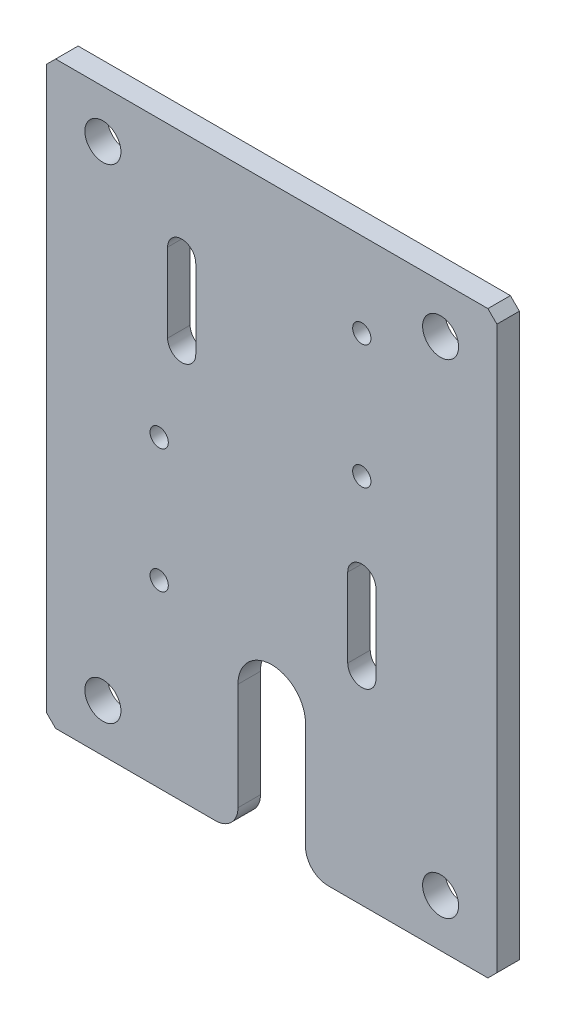
ISO-10303-21;
HEADER;
FILE_DESCRIPTION(('STEP AP214'),'2;1');
FILE_NAME('part.step','',(''),(''),'','','');
FILE_SCHEMA(('AUTOMOTIVE_DESIGN { 1 0 10303 214 1 1 1 1 }'));
ENDSEC;
DATA;
#1=APPLICATION_CONTEXT('core data for automotive mechanical design processes');
#2=APPLICATION_PROTOCOL_DEFINITION('international standard','automotive_design',2000,#1);
#3=PRODUCT_CONTEXT('',#1,'mechanical');
#4=PRODUCT('Part','Part','',(#3));
#5=PRODUCT_RELATED_PRODUCT_CATEGORY('part','',(#4));
#6=PRODUCT_DEFINITION_FORMATION('','',#4);
#7=PRODUCT_DEFINITION_CONTEXT('part definition',#1,'design');
#8=PRODUCT_DEFINITION('design','',#6,#7);
#9=PRODUCT_DEFINITION_SHAPE('','',#8);
#10=(LENGTH_UNIT() NAMED_UNIT(*) SI_UNIT(.MILLI.,.METRE.));
#11=(NAMED_UNIT(*) PLANE_ANGLE_UNIT() SI_UNIT($,.RADIAN.));
#12=(NAMED_UNIT(*) SI_UNIT($,.STERADIAN.) SOLID_ANGLE_UNIT());
#13=UNCERTAINTY_MEASURE_WITH_UNIT(LENGTH_MEASURE(1.E-05),#10,'distance_accuracy_value','');
#14=(GEOMETRIC_REPRESENTATION_CONTEXT(3) GLOBAL_UNCERTAINTY_ASSIGNED_CONTEXT((#13)) GLOBAL_UNIT_ASSIGNED_CONTEXT((#10,
#11,#12)) REPRESENTATION_CONTEXT('',''));
#15=CARTESIAN_POINT('',(0.,0.,0.));
#16=DIRECTION('',(0.,0.,1.));
#17=DIRECTION('',(1.,0.,0.));
#18=AXIS2_PLACEMENT_3D('',#15,#16,#17);
#19=CARTESIAN_POINT('',(20.,20.7000000430332,0.));
#20=DIRECTION('',(0.707106781186603,0.707106781186493,0.));
#21=DIRECTION('',(-0.707106781186493,0.707106781186603,0.));
#22=AXIS2_PLACEMENT_3D('',#19,#20,#21);
#23=PLANE('',#22);
#24=DIRECTION('',(-0.707106781186493,0.707106781186603,0.));
#25=VECTOR('',#24,1.);
#26=CARTESIAN_POINT('',(20.,20.7000000430332,2.));
#27=LINE('',#26,#25);
#28=CARTESIAN_POINT('',(19.2000000430334,21.5,2.));
#29=VERTEX_POINT('',#28);
#30=CARTESIAN_POINT('',(20.,20.7000000430332,2.));
#31=VERTEX_POINT('',#30);
#32=EDGE_CURVE('E306',#29,#31,#27,.F.);
#33=ORIENTED_EDGE('',*,*,#32,.T.);
#34=DIRECTION('',(0.,0.,-1.));
#35=VECTOR('',#34,1.);
#36=CARTESIAN_POINT('',(20.,20.7000000430332,0.));
#37=LINE('',#36,#35);
#38=CARTESIAN_POINT('',(20.,20.7000000430332,0.));
#39=VERTEX_POINT('',#38);
#40=EDGE_CURVE('E263',#39,#31,#37,.F.);
#41=ORIENTED_EDGE('',*,*,#40,.F.);
#42=DIRECTION('',(-0.707106781186457,0.707106781186638,0.));
#43=VECTOR('',#42,1.);
#44=CARTESIAN_POINT('',(20.,20.7000000430332,0.));
#45=LINE('',#44,#43);
#46=CARTESIAN_POINT('',(19.2000000430334,21.5,0.));
#47=VERTEX_POINT('',#46);
#48=EDGE_CURVE('E269',#39,#47,#45,.T.);
#49=ORIENTED_EDGE('',*,*,#48,.T.);
#50=DIRECTION('',(0.,0.,1.));
#51=VECTOR('',#50,1.);
#52=CARTESIAN_POINT('',(19.2000000430334,21.5,0.));
#53=LINE('',#52,#51);
#54=EDGE_CURVE('E254',#29,#47,#53,.F.);
#55=ORIENTED_EDGE('',*,*,#54,.F.);
#56=EDGE_LOOP('',(#33,#41,#49,#55));
#57=FACE_BOUND('',#56,.T.);
#58=ADVANCED_FACE('F16',(#57),#23,.T.);
#59=CARTESIAN_POINT('',(-19.2000000430334,21.5,0.));
#60=DIRECTION('',(-0.707106781186605,0.707106781186491,0.));
#61=DIRECTION('',(-0.707106781186491,-0.707106781186605,0.));
#62=AXIS2_PLACEMENT_3D('',#59,#60,#61);
#63=PLANE('',#62);
#64=DIRECTION('',(-0.707106781186491,-0.707106781186605,0.));
#65=VECTOR('',#64,1.);
#66=CARTESIAN_POINT('',(-19.2000000430334,21.5,2.));
#67=LINE('',#66,#65);
#68=CARTESIAN_POINT('',(-20.0000000430334,20.6999999999999,2.));
#69=VERTEX_POINT('',#68);
#70=CARTESIAN_POINT('',(-19.2000000430334,21.5,2.));
#71=VERTEX_POINT('',#70);
#72=EDGE_CURVE('E165',#69,#71,#67,.F.);
#73=ORIENTED_EDGE('',*,*,#72,.T.);
#74=DIRECTION('',(0.,0.,1.));
#75=VECTOR('',#74,1.);
#76=CARTESIAN_POINT('',(-19.2000000430334,21.5,0.));
#77=LINE('',#76,#75);
#78=CARTESIAN_POINT('',(-19.2000000430334,21.5,0.));
#79=VERTEX_POINT('',#78);
#80=EDGE_CURVE('E257',#79,#71,#77,.T.);
#81=ORIENTED_EDGE('',*,*,#80,.F.);
#82=DIRECTION('',(-0.707106781186501,-0.707106781186594,0.));
#83=VECTOR('',#82,1.);
#84=CARTESIAN_POINT('',(-19.2000000430334,21.5,0.));
#85=LINE('',#84,#83);
#86=CARTESIAN_POINT('',(-20.0000000430334,20.6999999999999,0.));
#87=VERTEX_POINT('',#86);
#88=EDGE_CURVE('E267',#79,#87,#85,.T.);
#89=ORIENTED_EDGE('',*,*,#88,.T.);
#90=DIRECTION('',(0.,0.,1.));
#91=VECTOR('',#90,1.);
#92=CARTESIAN_POINT('',(-20.0000000430334,20.6999999999999,0.));
#93=LINE('',#92,#91);
#94=EDGE_CURVE('E250',#69,#87,#93,.F.);
#95=ORIENTED_EDGE('',*,*,#94,.F.);
#96=EDGE_LOOP('',(#73,#81,#89,#95));
#97=FACE_BOUND('',#96,.T.);
#98=ADVANCED_FACE('F569',(#97),#63,.T.);
#99=CARTESIAN_POINT('',(-19.6000000430334,-29.6000000460307,0.));
#100=DIRECTION('',(-0.707106780524991,-0.707106781848104,0.));
#101=DIRECTION('',(0.707106781848104,-0.707106780524991,0.));
#102=AXIS2_PLACEMENT_3D('',#99,#100,#101);
#103=PLANE('',#102);
#104=DIRECTION('',(0.70710678184809,-0.707106780525005,0.));
#105=VECTOR('',#104,1.);
#106=CARTESIAN_POINT('',(-20.0000000430334,-29.2000000467791,0.));
#107=LINE('',#106,#105);
#108=CARTESIAN_POINT('',(-20.0000000430334,-29.2000000467791,0.));
#109=VERTEX_POINT('',#108);
#110=CARTESIAN_POINT('',(-19.2000000430334,-30.0000000452822,0.));
#111=VERTEX_POINT('',#110);
#112=EDGE_CURVE('E132',#109,#111,#107,.T.);
#113=ORIENTED_EDGE('',*,*,#112,.T.);
#114=DIRECTION('',(0.,0.,1.));
#115=VECTOR('',#114,1.);
#116=CARTESIAN_POINT('',(-19.2000000430334,-30.0000000452822,0.));
#117=LINE('',#116,#115);
#118=CARTESIAN_POINT('',(-19.2000000430334,-30.0000000452822,2.));
#119=VERTEX_POINT('',#118);
#120=EDGE_CURVE('E168',#119,#111,#117,.F.);
#121=ORIENTED_EDGE('',*,*,#120,.F.);
#122=DIRECTION('',(0.707106781848104,-0.707106780524991,0.));
#123=VECTOR('',#122,1.);
#124=CARTESIAN_POINT('',(-19.6000000430334,-29.6000000460307,2.));
#125=LINE('',#124,#123);
#126=CARTESIAN_POINT('',(-20.0000000430334,-29.2000000467791,2.));
#127=VERTEX_POINT('',#126);
#128=EDGE_CURVE('E154',#119,#127,#125,.F.);
#129=ORIENTED_EDGE('',*,*,#128,.T.);
#130=DIRECTION('',(0.,0.,1.));
#131=VECTOR('',#130,1.);
#132=CARTESIAN_POINT('',(-20.0000000430334,-29.2000000467791,0.));
#133=LINE('',#132,#131);
#134=EDGE_CURVE('E253',#109,#127,#133,.T.);
#135=ORIENTED_EDGE('',*,*,#134,.F.);
#136=EDGE_LOOP('',(#113,#121,#129,#135));
#137=FACE_BOUND('',#136,.T.);
#138=ADVANCED_FACE('F169',(#137),#103,.T.);
#139=CARTESIAN_POINT('',(19.6,-29.6,0.));
#140=DIRECTION('',(0.707106781186548,-0.707106781186548,0.));
#141=DIRECTION('',(0.707106781186548,0.707106781186548,0.));
#142=AXIS2_PLACEMENT_3D('',#139,#140,#141);
#143=PLANE('',#142);
#144=DIRECTION('',(0.707106781186547,0.707106781186547,0.));
#145=VECTOR('',#144,1.);
#146=CARTESIAN_POINT('',(19.2,-30.,0.));
#147=LINE('',#146,#145);
#148=CARTESIAN_POINT('',(19.2,-30.,0.));
#149=VERTEX_POINT('',#148);
#150=CARTESIAN_POINT('',(20.,-29.2,0.));
#151=VERTEX_POINT('',#150);
#152=EDGE_CURVE('E284',#149,#151,#147,.T.);
#153=ORIENTED_EDGE('',*,*,#152,.T.);
#154=DIRECTION('',(0.,0.,-1.));
#155=VECTOR('',#154,1.);
#156=CARTESIAN_POINT('',(20.,-29.2,0.));
#157=LINE('',#156,#155);
#158=CARTESIAN_POINT('',(20.,-29.2,2.));
#159=VERTEX_POINT('',#158);
#160=EDGE_CURVE('E287',#159,#151,#157,.T.);
#161=ORIENTED_EDGE('',*,*,#160,.F.);
#162=DIRECTION('',(0.707106781186548,0.707106781186548,0.));
#163=VECTOR('',#162,1.);
#164=CARTESIAN_POINT('',(19.6,-29.6,2.));
#165=LINE('',#164,#163);
#166=CARTESIAN_POINT('',(19.2,-30.,2.));
#167=VERTEX_POINT('',#166);
#168=EDGE_CURVE('E164',#159,#167,#165,.F.);
#169=ORIENTED_EDGE('',*,*,#168,.T.);
#170=DIRECTION('',(0.,0.,-1.));
#171=VECTOR('',#170,1.);
#172=CARTESIAN_POINT('',(19.2,-30.,0.));
#173=LINE('',#172,#171);
#174=EDGE_CURVE('E227',#149,#167,#173,.F.);
#175=ORIENTED_EDGE('',*,*,#174,.F.);
#176=EDGE_LOOP('',(#153,#161,#169,#175));
#177=FACE_BOUND('',#176,.T.);
#178=ADVANCED_FACE('F508',(#177),#143,.T.);
#179=CARTESIAN_POINT('',(-2.15166817696399E-08,-4.25000002338956,0.));
#180=DIRECTION('',(0.,0.,1.));
#181=DIRECTION('',(1.,0.,0.));
#182=AXIS2_PLACEMENT_3D('',#179,#180,#181);
#183=PLANE('',#182);
#184=CARTESIAN_POINT('',(-10.,-13.9999999999892,0.));
#185=DIRECTION('',(0.,0.,1.));
#186=DIRECTION('',(1.,0.,0.));
#187=AXIS2_PLACEMENT_3D('',#184,#185,#186);
#188=CIRCLE('',#187,0.8115);
#189=CARTESIAN_POINT('',(-9.1885,-13.9999999999892,0.));
#190=VERTEX_POINT('',#189);
#191=EDGE_CURVE('E328',#190,#190,#188,.T.);
#192=ORIENTED_EDGE('',*,*,#191,.T.);
#193=EDGE_LOOP('',(#192));
#194=FACE_BOUND('',#193,.T.);
#195=CARTESIAN_POINT('',(8.,14.0000000000108,0.));
#196=DIRECTION('',(0.,0.,1.));
#197=DIRECTION('',(1.,0.,0.));
#198=AXIS2_PLACEMENT_3D('',#195,#196,#197);
#199=CIRCLE('',#198,0.8115);
#200=CARTESIAN_POINT('',(8.8115,14.0000000000108,0.));
#201=VERTEX_POINT('',#200);
#202=EDGE_CURVE('E380',#201,#201,#199,.T.);
#203=ORIENTED_EDGE('',*,*,#202,.T.);
#204=EDGE_LOOP('',(#203));
#205=FACE_BOUND('',#204,.T.);
#206=CARTESIAN_POINT('',(8.,3.00000000001078,0.));
#207=DIRECTION('',(0.,0.,1.));
#208=DIRECTION('',(1.,0.,0.));
#209=AXIS2_PLACEMENT_3D('',#206,#207,#208);
#210=CIRCLE('',#209,0.8115);
#211=CARTESIAN_POINT('',(8.8115,3.00000000001078,0.));
#212=VERTEX_POINT('',#211);
#213=EDGE_CURVE('E383',#212,#212,#210,.T.);
#214=ORIENTED_EDGE('',*,*,#213,.T.);
#215=EDGE_LOOP('',(#214));
#216=FACE_BOUND('',#215,.T.);
#217=CARTESIAN_POINT('',(-10.,-2.99999999998922,0.));
#218=DIRECTION('',(0.,0.,1.));
#219=DIRECTION('',(1.,0.,0.));
#220=AXIS2_PLACEMENT_3D('',#217,#218,#219);
#221=CIRCLE('',#220,0.8115);
#222=CARTESIAN_POINT('',(-9.1885,-2.99999999998922,0.));
#223=VERTEX_POINT('',#222);
#224=EDGE_CURVE('E386',#223,#223,#221,.T.);
#225=ORIENTED_EDGE('',*,*,#224,.T.);
#226=EDGE_LOOP('',(#225));
#227=FACE_BOUND('',#226,.T.);
#228=CARTESIAN_POINT('',(15.,-25.7500000374233,0.));
#229=DIRECTION('',(0.,0.,1.));
#230=DIRECTION('',(1.,0.,0.));
#231=AXIS2_PLACEMENT_3D('',#228,#229,#230);
#232=CIRCLE('',#231,1.6);
#233=CARTESIAN_POINT('',(16.6,-25.7500000374233,0.));
#234=VERTEX_POINT('',#233);
#235=EDGE_CURVE('E389',#234,#234,#232,.T.);
#236=ORIENTED_EDGE('',*,*,#235,.T.);
#237=EDGE_LOOP('',(#236));
#238=FACE_BOUND('',#237,.T.);
#239=CARTESIAN_POINT('',(-15.,-25.7500000374233,0.));
#240=DIRECTION('',(0.,0.,1.));
#241=DIRECTION('',(1.,0.,0.));
#242=AXIS2_PLACEMENT_3D('',#239,#240,#241);
#243=CIRCLE('',#242,1.6);
#244=CARTESIAN_POINT('',(-13.4,-25.7500000374233,0.));
#245=VERTEX_POINT('',#244);
#246=EDGE_CURVE('E392',#245,#245,#243,.T.);
#247=ORIENTED_EDGE('',*,*,#246,.T.);
#248=EDGE_LOOP('',(#247));
#249=FACE_BOUND('',#248,.T.);
#250=CARTESIAN_POINT('',(15.,17.25,0.));
#251=DIRECTION('',(0.,0.,1.));
#252=DIRECTION('',(1.,0.,0.));
#253=AXIS2_PLACEMENT_3D('',#250,#251,#252);
#254=CIRCLE('',#253,1.6);
#255=CARTESIAN_POINT('',(16.6,17.25,0.));
#256=VERTEX_POINT('',#255);
#257=EDGE_CURVE('E395',#256,#256,#254,.T.);
#258=ORIENTED_EDGE('',*,*,#257,.T.);
#259=EDGE_LOOP('',(#258));
#260=FACE_BOUND('',#259,.T.);
#261=CARTESIAN_POINT('',(-15.,17.25,0.));
#262=DIRECTION('',(0.,0.,1.));
#263=DIRECTION('',(1.,0.,0.));
#264=AXIS2_PLACEMENT_3D('',#261,#262,#263);
#265=CIRCLE('',#264,1.6);
#266=CARTESIAN_POINT('',(-13.4,17.25,0.));
#267=VERTEX_POINT('',#266);
#268=EDGE_CURVE('E193',#267,#267,#265,.T.);
#269=ORIENTED_EDGE('',*,*,#268,.T.);
#270=EDGE_LOOP('',(#269));
#271=FACE_BOUND('',#270,.T.);
#272=DIRECTION('',(-1.38302068210448E-12,1.,0.));
#273=VECTOR('',#272,1.);
#274=CARTESIAN_POINT('',(-9.25000000000533,5.00000000000767,0.));
#275=LINE('',#274,#273);
#276=CARTESIAN_POINT('',(-9.25000000000533,5.00000000000767,0.));
#277=VERTEX_POINT('',#276);
#278=CARTESIAN_POINT('',(-9.25000000001501,12.0000000000077,0.));
#279=VERTEX_POINT('',#278);
#280=EDGE_CURVE('E197',#277,#279,#275,.T.);
#281=ORIENTED_EDGE('',*,*,#280,.F.);
#282=CARTESIAN_POINT('',(-8.00000000000484,5.0000000000094,0.));
#283=DIRECTION('',(0.,0.,1.));
#284=DIRECTION('',(1.,0.,0.));
#285=AXIS2_PLACEMENT_3D('',#282,#283,#284);
#286=CIRCLE('',#285,1.25000000000049);
#287=CARTESIAN_POINT('',(-6.75000000000435,5.00000000001026,0.));
#288=VERTEX_POINT('',#287);
#289=EDGE_CURVE('E200',#277,#288,#286,.T.);
#290=ORIENTED_EDGE('',*,*,#289,.T.);
#291=DIRECTION('',(1.38333788868294E-12,-1.,0.));
#292=VECTOR('',#291,1.);
#293=CARTESIAN_POINT('',(-6.75000000001404,12.0000000000111,0.));
#294=LINE('',#293,#292);
#295=CARTESIAN_POINT('',(-6.75000000001404,12.0000000000111,0.));
#296=VERTEX_POINT('',#295);
#297=EDGE_CURVE('E204',#296,#288,#294,.T.);
#298=ORIENTED_EDGE('',*,*,#297,.F.);
#299=CARTESIAN_POINT('',(-8.00000000001453,12.0000000000094,0.));
#300=DIRECTION('',(0.,0.,1.));
#301=DIRECTION('',(1.,0.,0.));
#302=AXIS2_PLACEMENT_3D('',#299,#300,#301);
#303=CIRCLE('',#302,1.25000000000049);
#304=EDGE_CURVE('E209',#296,#279,#303,.T.);
#305=ORIENTED_EDGE('',*,*,#304,.T.);
#306=EDGE_LOOP('',(#281,#290,#298,#305));
#307=FACE_BOUND('',#306,.T.);
#308=DIRECTION('',(1.51339258585223E-12,-1.,0.));
#309=VECTOR('',#308,1.);
#310=CARTESIAN_POINT('',(9.24999999999629,-4.99999999998575,0.));
#311=LINE('',#310,#309);
#312=CARTESIAN_POINT('',(9.24999999999629,-4.99999999998575,0.));
#313=VERTEX_POINT('',#312);
#314=CARTESIAN_POINT('',(9.25000000000688,-11.9999999999908,0.));
#315=VERTEX_POINT('',#314);
#316=EDGE_CURVE('E214',#313,#315,#311,.T.);
#317=ORIENTED_EDGE('',*,*,#316,.F.);
#318=CARTESIAN_POINT('',(7.99999999999632,-4.99999999998764,0.));
#319=DIRECTION('',(0.,0.,1.));
#320=DIRECTION('',(1.,0.,0.));
#321=AXIS2_PLACEMENT_3D('',#318,#319,#320);
#322=CIRCLE('',#321,1.24999999999998);
#323=CARTESIAN_POINT('',(6.74999999999634,-4.99999999998953,0.));
#324=VERTEX_POINT('',#323);
#325=EDGE_CURVE('E218',#313,#324,#322,.T.);
#326=ORIENTED_EDGE('',*,*,#325,.T.);
#327=DIRECTION('',(-1.51291677598453E-12,1.,0.));
#328=VECTOR('',#327,1.);
#329=CARTESIAN_POINT('',(6.75000000000693,-11.9999999999946,0.));
#330=LINE('',#329,#328);
#331=CARTESIAN_POINT('',(6.75000000000693,-11.9999999999946,0.));
#332=VERTEX_POINT('',#331);
#333=EDGE_CURVE('E222',#332,#324,#330,.T.);
#334=ORIENTED_EDGE('',*,*,#333,.F.);
#335=CARTESIAN_POINT('',(8.00000000000368,-11.9999999999927,0.));
#336=DIRECTION('',(0.,0.,1.));
#337=DIRECTION('',(1.,0.,0.));
#338=AXIS2_PLACEMENT_3D('',#335,#336,#337);
#339=CIRCLE('',#338,1.24999999999675);
#340=EDGE_CURVE('E279',#332,#315,#339,.T.);
#341=ORIENTED_EDGE('',*,*,#340,.T.);
#342=EDGE_LOOP('',(#317,#326,#334,#341));
#343=FACE_BOUND('',#342,.T.);
#344=DIRECTION('',(1.,0.,0.));
#345=VECTOR('',#344,1.);
#346=CARTESIAN_POINT('',(5.,-30.,0.));
#347=LINE('',#346,#345);
#348=CARTESIAN_POINT('',(5.,-30.,0.));
#349=VERTEX_POINT('',#348);
#350=EDGE_CURVE('E226',#349,#149,#347,.T.);
#351=ORIENTED_EDGE('',*,*,#350,.F.);
#352=CARTESIAN_POINT('',(5.,-28.,0.));
#353=DIRECTION('',(0.,0.,1.));
#354=DIRECTION('',(1.,0.,0.));
#355=AXIS2_PLACEMENT_3D('',#352,#353,#354);
#356=CIRCLE('',#355,2.);
#357=CARTESIAN_POINT('',(3.,-28.,0.));
#358=VERTEX_POINT('',#357);
#359=EDGE_CURVE('E235',#358,#349,#356,.T.);
#360=ORIENTED_EDGE('',*,*,#359,.F.);
#361=DIRECTION('',(0.,1.,0.));
#362=VECTOR('',#361,1.);
#363=CARTESIAN_POINT('',(3.,-18.4999225772671,0.));
#364=LINE('',#363,#362);
#365=CARTESIAN_POINT('',(3.,-18.4999225772671,0.));
#366=VERTEX_POINT('',#365);
#367=EDGE_CURVE('E239',#366,#358,#364,.F.);
#368=ORIENTED_EDGE('',*,*,#367,.F.);
#369=CARTESIAN_POINT('',(0.,-18.5,0.));
#370=DIRECTION('',(0.,0.,1.));
#371=DIRECTION('',(1.,0.,0.));
#372=AXIS2_PLACEMENT_3D('',#369,#370,#371);
#373=CIRCLE('',#372,3.);
#374=CARTESIAN_POINT('',(-2.99999999950058,-18.4999225852044,0.));
#375=VERTEX_POINT('',#374);
#376=EDGE_CURVE('E242',#366,#375,#373,.T.);
#377=ORIENTED_EDGE('',*,*,#376,.T.);
#378=DIRECTION('',(0.,1.,0.));
#379=VECTOR('',#378,1.);
#380=CARTESIAN_POINT('',(-3.,-28.0000000187105,0.));
#381=LINE('',#380,#379);
#382=CARTESIAN_POINT('',(-3.,-28.0000000187105,0.));
#383=VERTEX_POINT('',#382);
#384=EDGE_CURVE('E246',#383,#375,#381,.T.);
#385=ORIENTED_EDGE('',*,*,#384,.F.);
#386=CARTESIAN_POINT('',(-5.0000000000012,-28.0000000187104,0.));
#387=DIRECTION('',(0.,0.,1.));
#388=DIRECTION('',(1.,0.,0.));
#389=AXIS2_PLACEMENT_3D('',#386,#387,#388);
#390=CIRCLE('',#389,2.0000000000012);
#391=CARTESIAN_POINT('',(-4.99999999625887,-30.0000000187116,0.));
#392=VERTEX_POINT('',#391);
#393=EDGE_CURVE('E19',#392,#383,#390,.T.);
#394=ORIENTED_EDGE('',*,*,#393,.F.);
#395=DIRECTION('',(1.,1.87116484685734E-09,0.));
#396=VECTOR('',#395,1.);
#397=CARTESIAN_POINT('',(-20.0000000430334,-30.0000000467791,0.));
#398=LINE('',#397,#396);
#399=EDGE_CURVE('E171',#111,#392,#398,.T.);
#400=ORIENTED_EDGE('',*,*,#399,.F.);
#401=ORIENTED_EDGE('',*,*,#112,.F.);
#402=DIRECTION('',(0.,1.,0.));
#403=VECTOR('',#402,1.);
#404=CARTESIAN_POINT('',(-20.0000000430334,20.6999999999999,0.));
#405=LINE('',#404,#403);
#406=EDGE_CURVE('E172',#87,#109,#405,.F.);
#407=ORIENTED_EDGE('',*,*,#406,.F.);
#408=ORIENTED_EDGE('',*,*,#88,.F.);
#409=DIRECTION('',(1.,0.,0.));
#410=VECTOR('',#409,1.);
#411=CARTESIAN_POINT('',(19.2000000430334,21.5,0.));
#412=LINE('',#411,#410);
#413=EDGE_CURVE('E260',#47,#79,#412,.F.);
#414=ORIENTED_EDGE('',*,*,#413,.F.);
#415=ORIENTED_EDGE('',*,*,#48,.F.);
#416=DIRECTION('',(0.,1.,0.));
#417=VECTOR('',#416,1.);
#418=CARTESIAN_POINT('',(20.,-30.,0.));
#419=LINE('',#418,#417);
#420=EDGE_CURVE('E266',#151,#39,#419,.T.);
#421=ORIENTED_EDGE('',*,*,#420,.F.);
#422=ORIENTED_EDGE('',*,*,#152,.F.);
#423=EDGE_LOOP('',(#351,#360,#368,#377,#385,#394,#400,#401,#407,#408,#414,#415,#421,#422));
#424=FACE_BOUND('',#423,.T.);
#425=ADVANCED_FACE('F410',(#194,#205,#216,#227,#238,#249,#260,#271,#307,#343,#424),#183,.F.);
#426=CARTESIAN_POINT('',(20.,-30.,0.));
#427=DIRECTION('',(1.,0.,0.));
#428=DIRECTION('',(0.,0.,-1.));
#429=AXIS2_PLACEMENT_3D('',#426,#427,#428);
#430=PLANE('',#429);
#431=ORIENTED_EDGE('',*,*,#40,.T.);
#432=DIRECTION('',(0.,1.,0.));
#433=VECTOR('',#432,1.);
#434=CARTESIAN_POINT('',(20.,-4.25000002338956,2.));
#435=LINE('',#434,#433);
#436=EDGE_CURVE('E191',#159,#31,#435,.T.);
#437=ORIENTED_EDGE('',*,*,#436,.F.);
#438=ORIENTED_EDGE('',*,*,#160,.T.);
#439=ORIENTED_EDGE('',*,*,#420,.T.);
#440=EDGE_LOOP('',(#431,#437,#438,#439));
#441=FACE_BOUND('',#440,.T.);
#442=ADVANCED_FACE('F507',(#441),#430,.T.);
#443=CARTESIAN_POINT('',(19.2000000430334,21.5,0.));
#444=DIRECTION('',(0.,1.,0.));
#445=DIRECTION('',(0.,0.,1.));
#446=AXIS2_PLACEMENT_3D('',#443,#444,#445);
#447=PLANE('',#446);
#448=DIRECTION('',(1.,0.,0.));
#449=VECTOR('',#448,1.);
#450=CARTESIAN_POINT('',(-2.15166817696399E-08,21.5,2.));
#451=LINE('',#450,#449);
#452=EDGE_CURVE('E182',#29,#71,#451,.F.);
#453=ORIENTED_EDGE('',*,*,#452,.F.);
#454=ORIENTED_EDGE('',*,*,#54,.T.);
#455=ORIENTED_EDGE('',*,*,#413,.T.);
#456=ORIENTED_EDGE('',*,*,#80,.T.);
#457=EDGE_LOOP('',(#453,#454,#455,#456));
#458=FACE_BOUND('',#457,.T.);
#459=ADVANCED_FACE('F557',(#458),#447,.T.);
#460=CARTESIAN_POINT('',(-20.0000000430334,20.6999999999999,0.));
#461=DIRECTION('',(-1.,0.,0.));
#462=DIRECTION('',(0.,0.,1.));
#463=AXIS2_PLACEMENT_3D('',#460,#461,#462);
#464=PLANE('',#463);
#465=ORIENTED_EDGE('',*,*,#94,.T.);
#466=ORIENTED_EDGE('',*,*,#406,.T.);
#467=ORIENTED_EDGE('',*,*,#134,.T.);
#468=DIRECTION('',(0.,1.,0.));
#469=VECTOR('',#468,1.);
#470=CARTESIAN_POINT('',(-20.0000000430334,-4.25000002338956,2.));
#471=LINE('',#470,#469);
#472=EDGE_CURVE('E162',#69,#127,#471,.F.);
#473=ORIENTED_EDGE('',*,*,#472,.F.);
#474=EDGE_LOOP('',(#465,#466,#467,#473));
#475=FACE_BOUND('',#474,.T.);
#476=ADVANCED_FACE('F554',(#475),#464,.T.);
#477=CARTESIAN_POINT('',(-20.0000000430334,-30.0000000467791,0.));
#478=DIRECTION('',(1.87116484685734E-09,-1.,0.));
#479=DIRECTION('',(1.,1.87116484685734E-09,0.));
#480=AXIS2_PLACEMENT_3D('',#477,#478,#479);
#481=PLANE('',#480);
#482=DIRECTION('',(0.,0.,1.));
#483=VECTOR('',#482,1.);
#484=CARTESIAN_POINT('',(-4.99999999625887,-30.0000000187116,0.));
#485=LINE('',#484,#483);
#486=CARTESIAN_POINT('',(-4.99999999813004,-30.0000000319969,2.));
#487=VERTEX_POINT('',#486);
#488=EDGE_CURVE('E176',#487,#392,#485,.F.);
#489=ORIENTED_EDGE('',*,*,#488,.F.);
#490=DIRECTION('',(1.,0.,0.));
#491=VECTOR('',#490,1.);
#492=CARTESIAN_POINT('',(-2.15166817696399E-08,-30.0000000452822,2.));
#493=LINE('',#492,#491);
#494=EDGE_CURVE('E159',#119,#487,#493,.T.);
#495=ORIENTED_EDGE('',*,*,#494,.F.);
#496=ORIENTED_EDGE('',*,*,#120,.T.);
#497=ORIENTED_EDGE('',*,*,#399,.T.);
#498=EDGE_LOOP('',(#489,#495,#496,#497));
#499=FACE_BOUND('',#498,.T.);
#500=ADVANCED_FACE('F174',(#499),#481,.T.);
#501=CARTESIAN_POINT('',(-5.0000000000012,-28.0000000187104,0.));
#502=DIRECTION('',(0.,0.,1.));
#503=DIRECTION('',(1.,0.,0.));
#504=AXIS2_PLACEMENT_3D('',#501,#502,#503);
#505=CYLINDRICAL_SURFACE('',#504,2.0000000000012);
#506=CARTESIAN_POINT('',(-5.0000000000012,-28.0000000187104,2.));
#507=DIRECTION('',(0.,0.,1.));
#508=DIRECTION('',(1.,0.,0.));
#509=AXIS2_PLACEMENT_3D('',#506,#507,#508);
#510=CIRCLE('',#509,2.0000000000012);
#511=CARTESIAN_POINT('',(-3.,-28.0000000187105,2.));
#512=VERTEX_POINT('',#511);
#513=EDGE_CURVE('E178',#487,#512,#510,.T.);
#514=ORIENTED_EDGE('',*,*,#513,.F.);
#515=ORIENTED_EDGE('',*,*,#488,.T.);
#516=ORIENTED_EDGE('',*,*,#393,.T.);
#517=DIRECTION('',(0.,0.,-1.));
#518=VECTOR('',#517,1.);
#519=CARTESIAN_POINT('',(-3.,-28.0000000187105,0.));
#520=LINE('',#519,#518);
#521=EDGE_CURVE('E243',#512,#383,#520,.T.);
#522=ORIENTED_EDGE('',*,*,#521,.F.);
#523=EDGE_LOOP('',(#514,#515,#516,#522));
#524=FACE_BOUND('',#523,.T.);
#525=ADVANCED_FACE('F419',(#524),#505,.T.);
#526=CARTESIAN_POINT('',(-3.,-28.0000000187105,0.));
#527=DIRECTION('',(1.,0.,0.));
#528=DIRECTION('',(0.,0.,-1.));
#529=AXIS2_PLACEMENT_3D('',#526,#527,#528);
#530=PLANE('',#529);
#531=DIRECTION('',(0.,1.,0.));
#532=VECTOR('',#531,1.);
#533=CARTESIAN_POINT('',(-3.,-4.25000002338956,2.));
#534=LINE('',#533,#532);
#535=CARTESIAN_POINT('',(-2.99999999925087,-18.4999225852044,2.));
#536=VERTEX_POINT('',#535);
#537=EDGE_CURVE('E180',#512,#536,#534,.T.);
#538=ORIENTED_EDGE('',*,*,#537,.F.);
#539=ORIENTED_EDGE('',*,*,#521,.T.);
#540=ORIENTED_EDGE('',*,*,#384,.T.);
#541=DIRECTION('',(0.,0.,1.));
#542=VECTOR('',#541,1.);
#543=CARTESIAN_POINT('',(-2.99999999900116,-18.4999225852044,0.));
#544=LINE('',#543,#542);
#545=EDGE_CURVE('E240',#375,#536,#544,.T.);
#546=ORIENTED_EDGE('',*,*,#545,.T.);
#547=EDGE_LOOP('',(#538,#539,#540,#546));
#548=FACE_BOUND('',#547,.T.);
#549=ADVANCED_FACE('F417',(#548),#530,.T.);
#550=CARTESIAN_POINT('',(0.,-18.5,0.));
#551=DIRECTION('',(0.,0.,1.));
#552=DIRECTION('',(1.,0.,0.));
#553=AXIS2_PLACEMENT_3D('',#550,#551,#552);
#554=CYLINDRICAL_SURFACE('',#553,3.);
#555=DIRECTION('',(0.,0.,1.));
#556=VECTOR('',#555,1.);
#557=CARTESIAN_POINT('',(3.,-18.4999225772671,0.));
#558=LINE('',#557,#556);
#559=CARTESIAN_POINT('',(3.,-18.4999225772671,2.));
#560=VERTEX_POINT('',#559);
#561=EDGE_CURVE('E236',#560,#366,#558,.F.);
#562=ORIENTED_EDGE('',*,*,#561,.F.);
#563=CARTESIAN_POINT('',(0.,-18.5,2.));
#564=DIRECTION('',(0.,0.,1.));
#565=DIRECTION('',(1.,0.,0.));
#566=AXIS2_PLACEMENT_3D('',#563,#564,#565);
#567=CIRCLE('',#566,3.);
#568=EDGE_CURVE('E375',#536,#560,#567,.F.);
#569=ORIENTED_EDGE('',*,*,#568,.F.);
#570=ORIENTED_EDGE('',*,*,#545,.F.);
#571=ORIENTED_EDGE('',*,*,#376,.F.);
#572=EDGE_LOOP('',(#562,#569,#570,#571));
#573=FACE_BOUND('',#572,.T.);
#574=ADVANCED_FACE('F413',(#573),#554,.F.);
#575=CARTESIAN_POINT('',(3.,-18.4999225772671,0.));
#576=DIRECTION('',(-1.,0.,0.));
#577=DIRECTION('',(0.,0.,1.));
#578=AXIS2_PLACEMENT_3D('',#575,#576,#577);
#579=PLANE('',#578);
#580=DIRECTION('',(0.,1.,0.));
#581=VECTOR('',#580,1.);
#582=CARTESIAN_POINT('',(3.,-4.25000002338956,2.));
#583=LINE('',#582,#581);
#584=CARTESIAN_POINT('',(3.,-28.,2.));
#585=VERTEX_POINT('',#584);
#586=EDGE_CURVE('E374',#560,#585,#583,.F.);
#587=ORIENTED_EDGE('',*,*,#586,.F.);
#588=ORIENTED_EDGE('',*,*,#561,.T.);
#589=ORIENTED_EDGE('',*,*,#367,.T.);
#590=DIRECTION('',(0.,0.,1.));
#591=VECTOR('',#590,1.);
#592=CARTESIAN_POINT('',(3.,-28.,0.));
#593=LINE('',#592,#591);
#594=EDGE_CURVE('E230',#585,#358,#593,.F.);
#595=ORIENTED_EDGE('',*,*,#594,.F.);
#596=EDGE_LOOP('',(#587,#588,#589,#595));
#597=FACE_BOUND('',#596,.T.);
#598=ADVANCED_FACE('F542',(#597),#579,.T.);
#599=CARTESIAN_POINT('',(5.,-28.,0.));
#600=DIRECTION('',(0.,0.,1.));
#601=DIRECTION('',(1.,0.,0.));
#602=AXIS2_PLACEMENT_3D('',#599,#600,#601);
#603=CYLINDRICAL_SURFACE('',#602,2.);
#604=CARTESIAN_POINT('',(5.,-28.,2.));
#605=DIRECTION('',(0.,0.,1.));
#606=DIRECTION('',(1.,0.,0.));
#607=AXIS2_PLACEMENT_3D('',#604,#605,#606);
#608=CIRCLE('',#607,2.);
#609=CARTESIAN_POINT('',(5.,-30.,2.));
#610=VERTEX_POINT('',#609);
#611=EDGE_CURVE('E372',#585,#610,#608,.T.);
#612=ORIENTED_EDGE('',*,*,#611,.F.);
#613=ORIENTED_EDGE('',*,*,#594,.T.);
#614=ORIENTED_EDGE('',*,*,#359,.T.);
#615=DIRECTION('',(0.,0.,-1.));
#616=VECTOR('',#615,1.);
#617=CARTESIAN_POINT('',(5.,-30.,0.));
#618=LINE('',#617,#616);
#619=EDGE_CURVE('E223',#610,#349,#618,.T.);
#620=ORIENTED_EDGE('',*,*,#619,.F.);
#621=EDGE_LOOP('',(#612,#613,#614,#620));
#622=FACE_BOUND('',#621,.T.);
#623=ADVANCED_FACE('F535',(#622),#603,.T.);
#624=CARTESIAN_POINT('',(5.,-30.,0.));
#625=DIRECTION('',(0.,-1.,0.));
#626=DIRECTION('',(0.,0.,-1.));
#627=AXIS2_PLACEMENT_3D('',#624,#625,#626);
#628=PLANE('',#627);
#629=ORIENTED_EDGE('',*,*,#619,.T.);
#630=ORIENTED_EDGE('',*,*,#350,.T.);
#631=ORIENTED_EDGE('',*,*,#174,.T.);
#632=DIRECTION('',(1.,0.,0.));
#633=VECTOR('',#632,1.);
#634=CARTESIAN_POINT('',(-2.15166817696399E-08,-30.,2.));
#635=LINE('',#634,#633);
#636=EDGE_CURVE('E371',#610,#167,#635,.T.);
#637=ORIENTED_EDGE('',*,*,#636,.F.);
#638=EDGE_LOOP('',(#629,#630,#631,#637));
#639=FACE_BOUND('',#638,.T.);
#640=ADVANCED_FACE('F528',(#639),#628,.T.);
#641=CARTESIAN_POINT('',(8.00000000000368,-11.9999999999927,0.));
#642=DIRECTION('',(0.,0.,1.));
#643=DIRECTION('',(1.,0.,0.));
#644=AXIS2_PLACEMENT_3D('',#641,#642,#643);
#645=CYLINDRICAL_SURFACE('',#644,1.24999999999675);
#646=DIRECTION('',(0.,0.,1.));
#647=VECTOR('',#646,1.);
#648=CARTESIAN_POINT('',(6.75000000000693,-11.9999999999946,0.));
#649=LINE('',#648,#647);
#650=CARTESIAN_POINT('',(6.75000000000693,-11.9999999999936,2.));
#651=VERTEX_POINT('',#650);
#652=EDGE_CURVE('E219',#651,#332,#649,.F.);
#653=ORIENTED_EDGE('',*,*,#652,.F.);
#654=CARTESIAN_POINT('',(8.00000000000368,-11.9999999999927,2.));
#655=DIRECTION('',(0.,0.,1.));
#656=DIRECTION('',(1.,0.,0.));
#657=AXIS2_PLACEMENT_3D('',#654,#655,#656);
#658=CIRCLE('',#657,1.24999999999675);
#659=CARTESIAN_POINT('',(9.25000000000159,-11.9999999999918,2.));
#660=VERTEX_POINT('',#659);
#661=EDGE_CURVE('E367',#660,#651,#658,.F.);
#662=ORIENTED_EDGE('',*,*,#661,.F.);
#663=DIRECTION('',(0.,0.,1.));
#664=VECTOR('',#663,1.);
#665=CARTESIAN_POINT('',(9.25000000000688,-11.9999999999908,0.));
#666=LINE('',#665,#664);
#667=EDGE_CURVE('E210',#315,#660,#666,.T.);
#668=ORIENTED_EDGE('',*,*,#667,.F.);
#669=ORIENTED_EDGE('',*,*,#340,.F.);
#670=EDGE_LOOP('',(#653,#662,#668,#669));
#671=FACE_BOUND('',#670,.T.);
#672=ADVANCED_FACE('F526',(#671),#645,.F.);
#673=CARTESIAN_POINT('',(6.75000000000693,-11.9999999999946,0.));
#674=DIRECTION('',(1.,1.51291677598453E-12,0.));
#675=DIRECTION('',(-1.51291677598453E-12,1.,0.));
#676=AXIS2_PLACEMENT_3D('',#673,#674,#675);
#677=PLANE('',#676);
#678=DIRECTION('',(0.,1.,0.));
#679=VECTOR('',#678,1.);
#680=CARTESIAN_POINT('',(6.75000000000693,-4.25000002338956,2.));
#681=LINE('',#680,#679);
#682=CARTESIAN_POINT('',(6.75000000000164,-4.99999999998859,2.));
#683=VERTEX_POINT('',#682);
#684=EDGE_CURVE('E366',#651,#683,#681,.T.);
#685=ORIENTED_EDGE('',*,*,#684,.F.);
#686=ORIENTED_EDGE('',*,*,#652,.T.);
#687=ORIENTED_EDGE('',*,*,#333,.T.);
#688=DIRECTION('',(0.,0.,1.));
#689=VECTOR('',#688,1.);
#690=CARTESIAN_POINT('',(6.74999999999634,-4.99999999998953,0.));
#691=LINE('',#690,#689);
#692=EDGE_CURVE('E215',#324,#683,#691,.T.);
#693=ORIENTED_EDGE('',*,*,#692,.T.);
#694=EDGE_LOOP('',(#685,#686,#687,#693));
#695=FACE_BOUND('',#694,.T.);
#696=ADVANCED_FACE('F524',(#695),#677,.T.);
#697=CARTESIAN_POINT('',(7.99999999999632,-4.99999999998764,0.));
#698=DIRECTION('',(0.,0.,1.));
#699=DIRECTION('',(1.,0.,0.));
#700=AXIS2_PLACEMENT_3D('',#697,#698,#699);
#701=CYLINDRICAL_SURFACE('',#700,1.24999999999998);
#702=DIRECTION('',(0.,0.,1.));
#703=VECTOR('',#702,1.);
#704=CARTESIAN_POINT('',(9.24999999999629,-4.99999999998575,0.));
#705=LINE('',#704,#703);
#706=CARTESIAN_POINT('',(9.24999999999629,-4.9999999999867,2.));
#707=VERTEX_POINT('',#706);
#708=EDGE_CURVE('E205',#707,#313,#705,.F.);
#709=ORIENTED_EDGE('',*,*,#708,.F.);
#710=CARTESIAN_POINT('',(7.99999999999632,-4.99999999998764,2.));
#711=DIRECTION('',(0.,0.,1.));
#712=DIRECTION('',(1.,0.,0.));
#713=AXIS2_PLACEMENT_3D('',#710,#711,#712);
#714=CIRCLE('',#713,1.24999999999998);
#715=EDGE_CURVE('E362',#683,#707,#714,.F.);
#716=ORIENTED_EDGE('',*,*,#715,.F.);
#717=ORIENTED_EDGE('',*,*,#692,.F.);
#718=ORIENTED_EDGE('',*,*,#325,.F.);
#719=EDGE_LOOP('',(#709,#716,#717,#718));
#720=FACE_BOUND('',#719,.T.);
#721=ADVANCED_FACE('F518',(#720),#701,.F.);
#722=CARTESIAN_POINT('',(9.24999999999629,-4.99999999998575,0.));
#723=DIRECTION('',(-1.,-1.51339258585223E-12,0.));
#724=DIRECTION('',(1.51339258585223E-12,-1.,0.));
#725=AXIS2_PLACEMENT_3D('',#722,#723,#724);
#726=PLANE('',#725);
#727=DIRECTION('',(0.,1.,0.));
#728=VECTOR('',#727,1.);
#729=CARTESIAN_POINT('',(9.24999999999629,-4.25000002338956,2.));
#730=LINE('',#729,#728);
#731=EDGE_CURVE('E361',#707,#660,#730,.F.);
#732=ORIENTED_EDGE('',*,*,#731,.F.);
#733=ORIENTED_EDGE('',*,*,#708,.T.);
#734=ORIENTED_EDGE('',*,*,#316,.T.);
#735=ORIENTED_EDGE('',*,*,#667,.T.);
#736=EDGE_LOOP('',(#732,#733,#734,#735));
#737=FACE_BOUND('',#736,.T.);
#738=ADVANCED_FACE('F521',(#737),#726,.T.);
#739=CARTESIAN_POINT('',(-8.00000000001453,12.0000000000094,0.));
#740=DIRECTION('',(0.,0.,1.));
#741=DIRECTION('',(1.,0.,0.));
#742=AXIS2_PLACEMENT_3D('',#739,#740,#741);
#743=CYLINDRICAL_SURFACE('',#742,1.25000000000049);
#744=DIRECTION('',(0.,0.,1.));
#745=VECTOR('',#744,1.);
#746=CARTESIAN_POINT('',(-6.75000000001404,12.0000000000111,0.));
#747=LINE('',#746,#745);
#748=CARTESIAN_POINT('',(-6.75000000001404,12.0000000000103,2.));
#749=VERTEX_POINT('',#748);
#750=EDGE_CURVE('E201',#749,#296,#747,.F.);
#751=ORIENTED_EDGE('',*,*,#750,.F.);
#752=CARTESIAN_POINT('',(-8.00000000001453,12.0000000000094,2.));
#753=DIRECTION('',(0.,0.,1.));
#754=DIRECTION('',(1.,0.,0.));
#755=AXIS2_PLACEMENT_3D('',#752,#753,#754);
#756=CIRCLE('',#755,1.25000000000049);
#757=CARTESIAN_POINT('',(-9.25000000001017,12.0000000000086,2.));
#758=VERTEX_POINT('',#757);
#759=EDGE_CURVE('E358',#758,#749,#756,.F.);
#760=ORIENTED_EDGE('',*,*,#759,.F.);
#761=DIRECTION('',(0.,0.,1.));
#762=VECTOR('',#761,1.);
#763=CARTESIAN_POINT('',(-9.25000000001501,12.0000000000077,0.));
#764=LINE('',#763,#762);
#765=EDGE_CURVE('E194',#279,#758,#764,.T.);
#766=ORIENTED_EDGE('',*,*,#765,.F.);
#767=ORIENTED_EDGE('',*,*,#304,.F.);
#768=EDGE_LOOP('',(#751,#760,#766,#767));
#769=FACE_BOUND('',#768,.T.);
#770=ADVANCED_FACE('F445',(#769),#743,.F.);
#771=CARTESIAN_POINT('',(-6.75000000001404,12.0000000000111,0.));
#772=DIRECTION('',(-1.,-1.38333788868294E-12,0.));
#773=DIRECTION('',(1.38333788868294E-12,-1.,0.));
#774=AXIS2_PLACEMENT_3D('',#771,#772,#773);
#775=PLANE('',#774);
#776=DIRECTION('',(0.,1.,0.));
#777=VECTOR('',#776,1.);
#778=CARTESIAN_POINT('',(-6.75000000001404,-4.25000002338956,2.));
#779=LINE('',#778,#777);
#780=CARTESIAN_POINT('',(-6.75000000000919,5.0000000000094,2.));
#781=VERTEX_POINT('',#780);
#782=EDGE_CURVE('E357',#749,#781,#779,.F.);
#783=ORIENTED_EDGE('',*,*,#782,.F.);
#784=ORIENTED_EDGE('',*,*,#750,.T.);
#785=ORIENTED_EDGE('',*,*,#297,.T.);
#786=DIRECTION('',(0.,0.,1.));
#787=VECTOR('',#786,1.);
#788=CARTESIAN_POINT('',(-6.75000000000435,5.0000000000094,0.));
#789=LINE('',#788,#787);
#790=EDGE_CURVE('E198',#288,#781,#789,.T.);
#791=ORIENTED_EDGE('',*,*,#790,.T.);
#792=EDGE_LOOP('',(#783,#784,#785,#791));
#793=FACE_BOUND('',#792,.T.);
#794=ADVANCED_FACE('F448',(#793),#775,.T.);
#795=CARTESIAN_POINT('',(-8.00000000000484,5.0000000000094,0.));
#796=DIRECTION('',(0.,0.,1.));
#797=DIRECTION('',(1.,0.,0.));
#798=AXIS2_PLACEMENT_3D('',#795,#796,#797);
#799=CYLINDRICAL_SURFACE('',#798,1.25000000000049);
#800=DIRECTION('',(0.,0.,1.));
#801=VECTOR('',#800,1.);
#802=CARTESIAN_POINT('',(-9.25000000000533,5.00000000000767,0.));
#803=LINE('',#802,#801);
#804=CARTESIAN_POINT('',(-9.25000000000533,5.00000000000853,2.));
#805=VERTEX_POINT('',#804);
#806=EDGE_CURVE('E34',#805,#277,#803,.F.);
#807=ORIENTED_EDGE('',*,*,#806,.F.);
#808=CARTESIAN_POINT('',(-8.00000000000484,5.0000000000094,2.));
#809=DIRECTION('',(0.,0.,1.));
#810=DIRECTION('',(1.,0.,0.));
#811=AXIS2_PLACEMENT_3D('',#808,#809,#810);
#812=CIRCLE('',#811,1.25000000000049);
#813=EDGE_CURVE('E354',#781,#805,#812,.F.);
#814=ORIENTED_EDGE('',*,*,#813,.F.);
#815=ORIENTED_EDGE('',*,*,#790,.F.);
#816=ORIENTED_EDGE('',*,*,#289,.F.);
#817=EDGE_LOOP('',(#807,#814,#815,#816));
#818=FACE_BOUND('',#817,.T.);
#819=ADVANCED_FACE('F450',(#818),#799,.F.);
#820=CARTESIAN_POINT('',(-9.25000000000533,5.00000000000767,0.));
#821=DIRECTION('',(1.,1.38302068210448E-12,0.));
#822=DIRECTION('',(-1.38302068210448E-12,1.,0.));
#823=AXIS2_PLACEMENT_3D('',#820,#821,#822);
#824=PLANE('',#823);
#825=DIRECTION('',(0.,1.,0.));
#826=VECTOR('',#825,1.);
#827=CARTESIAN_POINT('',(-9.25000000000533,-4.25000002338956,2.));
#828=LINE('',#827,#826);
#829=EDGE_CURVE('E353',#805,#758,#828,.T.);
#830=ORIENTED_EDGE('',*,*,#829,.F.);
#831=ORIENTED_EDGE('',*,*,#806,.T.);
#832=ORIENTED_EDGE('',*,*,#280,.T.);
#833=ORIENTED_EDGE('',*,*,#765,.T.);
#834=EDGE_LOOP('',(#830,#831,#832,#833));
#835=FACE_BOUND('',#834,.T.);
#836=ADVANCED_FACE('F441',(#835),#824,.T.);
#837=CARTESIAN_POINT('',(-15.,17.25,0.));
#838=DIRECTION('',(0.,0.,1.));
#839=DIRECTION('',(1.,0.,0.));
#840=AXIS2_PLACEMENT_3D('',#837,#838,#839);
#841=CYLINDRICAL_SURFACE('',#840,1.6);
#842=ORIENTED_EDGE('',*,*,#268,.F.);
#843=EDGE_LOOP('',(#842));
#844=FACE_BOUND('',#843,.T.);
#845=CARTESIAN_POINT('',(-15.,17.25,2.));
#846=DIRECTION('',(0.,0.,1.));
#847=DIRECTION('',(1.,0.,0.));
#848=AXIS2_PLACEMENT_3D('',#845,#846,#847);
#849=CIRCLE('',#848,1.6);
#850=CARTESIAN_POINT('',(-13.4,17.25,2.));
#851=VERTEX_POINT('',#850);
#852=EDGE_CURVE('E350',#851,#851,#849,.F.);
#853=ORIENTED_EDGE('',*,*,#852,.F.);
#854=EDGE_LOOP('',(#853));
#855=FACE_BOUND('',#854,.T.);
#856=ADVANCED_FACE('F458',(#844,#855),#841,.F.);
#857=CARTESIAN_POINT('',(15.,17.25,0.));
#858=DIRECTION('',(0.,0.,1.));
#859=DIRECTION('',(1.,0.,0.));
#860=AXIS2_PLACEMENT_3D('',#857,#858,#859);
#861=CYLINDRICAL_SURFACE('',#860,1.6);
#862=ORIENTED_EDGE('',*,*,#257,.F.);
#863=EDGE_LOOP('',(#862));
#864=FACE_BOUND('',#863,.T.);
#865=CARTESIAN_POINT('',(15.,17.25,2.));
#866=DIRECTION('',(0.,0.,1.));
#867=DIRECTION('',(1.,0.,0.));
#868=AXIS2_PLACEMENT_3D('',#865,#866,#867);
#869=CIRCLE('',#868,1.6);
#870=CARTESIAN_POINT('',(16.6,17.25,2.));
#871=VERTEX_POINT('',#870);
#872=EDGE_CURVE('E347',#871,#871,#869,.F.);
#873=ORIENTED_EDGE('',*,*,#872,.F.);
#874=EDGE_LOOP('',(#873));
#875=FACE_BOUND('',#874,.T.);
#876=ADVANCED_FACE('F491',(#864,#875),#861,.F.);
#877=CARTESIAN_POINT('',(-15.,-25.7500000374233,0.));
#878=DIRECTION('',(0.,0.,1.));
#879=DIRECTION('',(1.,0.,0.));
#880=AXIS2_PLACEMENT_3D('',#877,#878,#879);
#881=CYLINDRICAL_SURFACE('',#880,1.6);
#882=ORIENTED_EDGE('',*,*,#246,.F.);
#883=EDGE_LOOP('',(#882));
#884=FACE_BOUND('',#883,.T.);
#885=CARTESIAN_POINT('',(-15.,-25.7500000374233,2.));
#886=DIRECTION('',(0.,0.,1.));
#887=DIRECTION('',(1.,0.,0.));
#888=AXIS2_PLACEMENT_3D('',#885,#886,#887);
#889=CIRCLE('',#888,1.6);
#890=CARTESIAN_POINT('',(-13.4,-25.7500000374233,2.));
#891=VERTEX_POINT('',#890);
#892=EDGE_CURVE('E344',#891,#891,#889,.F.);
#893=ORIENTED_EDGE('',*,*,#892,.F.);
#894=EDGE_LOOP('',(#893));
#895=FACE_BOUND('',#894,.T.);
#896=ADVANCED_FACE('F487',(#884,#895),#881,.F.);
#897=CARTESIAN_POINT('',(15.,-25.7500000374233,0.));
#898=DIRECTION('',(0.,0.,1.));
#899=DIRECTION('',(1.,0.,0.));
#900=AXIS2_PLACEMENT_3D('',#897,#898,#899);
#901=CYLINDRICAL_SURFACE('',#900,1.6);
#902=ORIENTED_EDGE('',*,*,#235,.F.);
#903=EDGE_LOOP('',(#902));
#904=FACE_BOUND('',#903,.T.);
#905=CARTESIAN_POINT('',(15.,-25.7500000374233,2.));
#906=DIRECTION('',(0.,0.,1.));
#907=DIRECTION('',(1.,0.,0.));
#908=AXIS2_PLACEMENT_3D('',#905,#906,#907);
#909=CIRCLE('',#908,1.6);
#910=CARTESIAN_POINT('',(16.6,-25.7500000374233,2.));
#911=VERTEX_POINT('',#910);
#912=EDGE_CURVE('E341',#911,#911,#909,.F.);
#913=ORIENTED_EDGE('',*,*,#912,.F.);
#914=EDGE_LOOP('',(#913));
#915=FACE_BOUND('',#914,.T.);
#916=ADVANCED_FACE('F483',(#904,#915),#901,.F.);
#917=CARTESIAN_POINT('',(-10.,-2.99999999998922,0.));
#918=DIRECTION('',(0.,0.,1.));
#919=DIRECTION('',(1.,0.,0.));
#920=AXIS2_PLACEMENT_3D('',#917,#918,#919);
#921=CYLINDRICAL_SURFACE('',#920,0.8115);
#922=ORIENTED_EDGE('',*,*,#224,.F.);
#923=EDGE_LOOP('',(#922));
#924=FACE_BOUND('',#923,.T.);
#925=CARTESIAN_POINT('',(-10.,-2.99999999998922,2.));
#926=DIRECTION('',(0.,0.,1.));
#927=DIRECTION('',(1.,0.,0.));
#928=AXIS2_PLACEMENT_3D('',#925,#926,#927);
#929=CIRCLE('',#928,0.8115);
#930=CARTESIAN_POINT('',(-9.1885,-2.99999999998922,2.));
#931=VERTEX_POINT('',#930);
#932=EDGE_CURVE('E338',#931,#931,#929,.F.);
#933=ORIENTED_EDGE('',*,*,#932,.F.);
#934=EDGE_LOOP('',(#933));
#935=FACE_BOUND('',#934,.T.);
#936=ADVANCED_FACE('F479',(#924,#935),#921,.F.);
#937=CARTESIAN_POINT('',(8.,3.00000000001078,0.));
#938=DIRECTION('',(0.,0.,1.));
#939=DIRECTION('',(1.,0.,0.));
#940=AXIS2_PLACEMENT_3D('',#937,#938,#939);
#941=CYLINDRICAL_SURFACE('',#940,0.8115);
#942=ORIENTED_EDGE('',*,*,#213,.F.);
#943=EDGE_LOOP('',(#942));
#944=FACE_BOUND('',#943,.T.);
#945=CARTESIAN_POINT('',(8.,3.00000000001078,2.));
#946=DIRECTION('',(0.,0.,1.));
#947=DIRECTION('',(1.,0.,0.));
#948=AXIS2_PLACEMENT_3D('',#945,#946,#947);
#949=CIRCLE('',#948,0.8115);
#950=CARTESIAN_POINT('',(8.8115,3.00000000001078,2.));
#951=VERTEX_POINT('',#950);
#952=EDGE_CURVE('E335',#951,#951,#949,.F.);
#953=ORIENTED_EDGE('',*,*,#952,.F.);
#954=EDGE_LOOP('',(#953));
#955=FACE_BOUND('',#954,.T.);
#956=ADVANCED_FACE('F475',(#944,#955),#941,.F.);
#957=CARTESIAN_POINT('',(8.,14.0000000000108,0.));
#958=DIRECTION('',(0.,0.,1.));
#959=DIRECTION('',(1.,0.,0.));
#960=AXIS2_PLACEMENT_3D('',#957,#958,#959);
#961=CYLINDRICAL_SURFACE('',#960,0.8115);
#962=ORIENTED_EDGE('',*,*,#202,.F.);
#963=EDGE_LOOP('',(#962));
#964=FACE_BOUND('',#963,.T.);
#965=CARTESIAN_POINT('',(8.,14.0000000000108,2.));
#966=DIRECTION('',(0.,0.,1.));
#967=DIRECTION('',(1.,0.,0.));
#968=AXIS2_PLACEMENT_3D('',#965,#966,#967);
#969=CIRCLE('',#968,0.8115);
#970=CARTESIAN_POINT('',(8.8115,14.0000000000108,2.));
#971=VERTEX_POINT('',#970);
#972=EDGE_CURVE('E25',#971,#971,#969,.F.);
#973=ORIENTED_EDGE('',*,*,#972,.F.);
#974=EDGE_LOOP('',(#973));
#975=FACE_BOUND('',#974,.T.);
#976=ADVANCED_FACE('F468',(#964,#975),#961,.F.);
#977=CARTESIAN_POINT('',(-10.,-13.9999999999892,0.));
#978=DIRECTION('',(0.,0.,1.));
#979=DIRECTION('',(1.,0.,0.));
#980=AXIS2_PLACEMENT_3D('',#977,#978,#979);
#981=CYLINDRICAL_SURFACE('',#980,0.8115);
#982=ORIENTED_EDGE('',*,*,#191,.F.);
#983=EDGE_LOOP('',(#982));
#984=FACE_BOUND('',#983,.T.);
#985=CARTESIAN_POINT('',(-10.,-13.9999999999892,2.));
#986=DIRECTION('',(0.,0.,1.));
#987=DIRECTION('',(1.,0.,0.));
#988=AXIS2_PLACEMENT_3D('',#985,#986,#987);
#989=CIRCLE('',#988,0.8115);
#990=CARTESIAN_POINT('',(-9.1885,-13.9999999999892,2.));
#991=VERTEX_POINT('',#990);
#992=EDGE_CURVE('E11',#991,#991,#989,.F.);
#993=ORIENTED_EDGE('',*,*,#992,.F.);
#994=EDGE_LOOP('',(#993));
#995=FACE_BOUND('',#994,.T.);
#996=ADVANCED_FACE('F462',(#984,#995),#981,.F.);
#997=CARTESIAN_POINT('',(-2.15166817696399E-08,-4.25000002338956,2.));
#998=DIRECTION('',(0.,0.,1.));
#999=DIRECTION('',(1.,0.,0.));
#1000=AXIS2_PLACEMENT_3D('',#997,#998,#999);
#1001=PLANE('',#1000);
#1002=ORIENTED_EDGE('',*,*,#992,.T.);
#1003=EDGE_LOOP('',(#1002));
#1004=FACE_BOUND('',#1003,.T.);
#1005=ORIENTED_EDGE('',*,*,#972,.T.);
#1006=EDGE_LOOP('',(#1005));
#1007=FACE_BOUND('',#1006,.T.);
#1008=ORIENTED_EDGE('',*,*,#952,.T.);
#1009=EDGE_LOOP('',(#1008));
#1010=FACE_BOUND('',#1009,.T.);
#1011=ORIENTED_EDGE('',*,*,#932,.T.);
#1012=EDGE_LOOP('',(#1011));
#1013=FACE_BOUND('',#1012,.T.);
#1014=ORIENTED_EDGE('',*,*,#912,.T.);
#1015=EDGE_LOOP('',(#1014));
#1016=FACE_BOUND('',#1015,.T.);
#1017=ORIENTED_EDGE('',*,*,#892,.T.);
#1018=EDGE_LOOP('',(#1017));
#1019=FACE_BOUND('',#1018,.T.);
#1020=ORIENTED_EDGE('',*,*,#872,.T.);
#1021=EDGE_LOOP('',(#1020));
#1022=FACE_BOUND('',#1021,.T.);
#1023=ORIENTED_EDGE('',*,*,#852,.T.);
#1024=EDGE_LOOP('',(#1023));
#1025=FACE_BOUND('',#1024,.T.);
#1026=ORIENTED_EDGE('',*,*,#813,.T.);
#1027=ORIENTED_EDGE('',*,*,#829,.T.);
#1028=ORIENTED_EDGE('',*,*,#759,.T.);
#1029=ORIENTED_EDGE('',*,*,#782,.T.);
#1030=EDGE_LOOP('',(#1026,#1027,#1028,#1029));
#1031=FACE_BOUND('',#1030,.T.);
#1032=ORIENTED_EDGE('',*,*,#715,.T.);
#1033=ORIENTED_EDGE('',*,*,#731,.T.);
#1034=ORIENTED_EDGE('',*,*,#661,.T.);
#1035=ORIENTED_EDGE('',*,*,#684,.T.);
#1036=EDGE_LOOP('',(#1032,#1033,#1034,#1035));
#1037=FACE_BOUND('',#1036,.T.);
#1038=ORIENTED_EDGE('',*,*,#611,.T.);
#1039=ORIENTED_EDGE('',*,*,#636,.T.);
#1040=ORIENTED_EDGE('',*,*,#168,.F.);
#1041=ORIENTED_EDGE('',*,*,#436,.T.);
#1042=ORIENTED_EDGE('',*,*,#32,.F.);
#1043=ORIENTED_EDGE('',*,*,#452,.T.);
#1044=ORIENTED_EDGE('',*,*,#72,.F.);
#1045=ORIENTED_EDGE('',*,*,#472,.T.);
#1046=ORIENTED_EDGE('',*,*,#128,.F.);
#1047=ORIENTED_EDGE('',*,*,#494,.T.);
#1048=ORIENTED_EDGE('',*,*,#513,.T.);
#1049=ORIENTED_EDGE('',*,*,#537,.T.);
#1050=ORIENTED_EDGE('',*,*,#568,.T.);
#1051=ORIENTED_EDGE('',*,*,#586,.T.);
#1052=EDGE_LOOP('',(#1038,#1039,#1040,#1041,#1042,#1043,#1044,#1045,#1046,#1047,#1048,#1049,
#1050,#1051));
#1053=FACE_BOUND('',#1052,.T.);
#1054=ADVANCED_FACE('F156',(#1004,#1007,#1010,#1013,#1016,#1019,#1022,#1025,#1031,#1037,#1053),
#1001,.T.);
#1055=CLOSED_SHELL('',(#58,#98,#138,#178,#425,#442,#459,#476,#500,#525,#549,#574,#598,#623,#640,
#672,#696,#721,#738,#770,#794,#819,#836,#856,#876,#896,#916,#936,#956,#976,#996,#1054));
#1056=MANIFOLD_SOLID_BREP('B1',#1055);
#1057=ADVANCED_BREP_SHAPE_REPRESENTATION('',(#18,#1056),#14);
#1058=SHAPE_DEFINITION_REPRESENTATION(#9,#1057);
ENDSEC;
END-ISO-10303-21;
